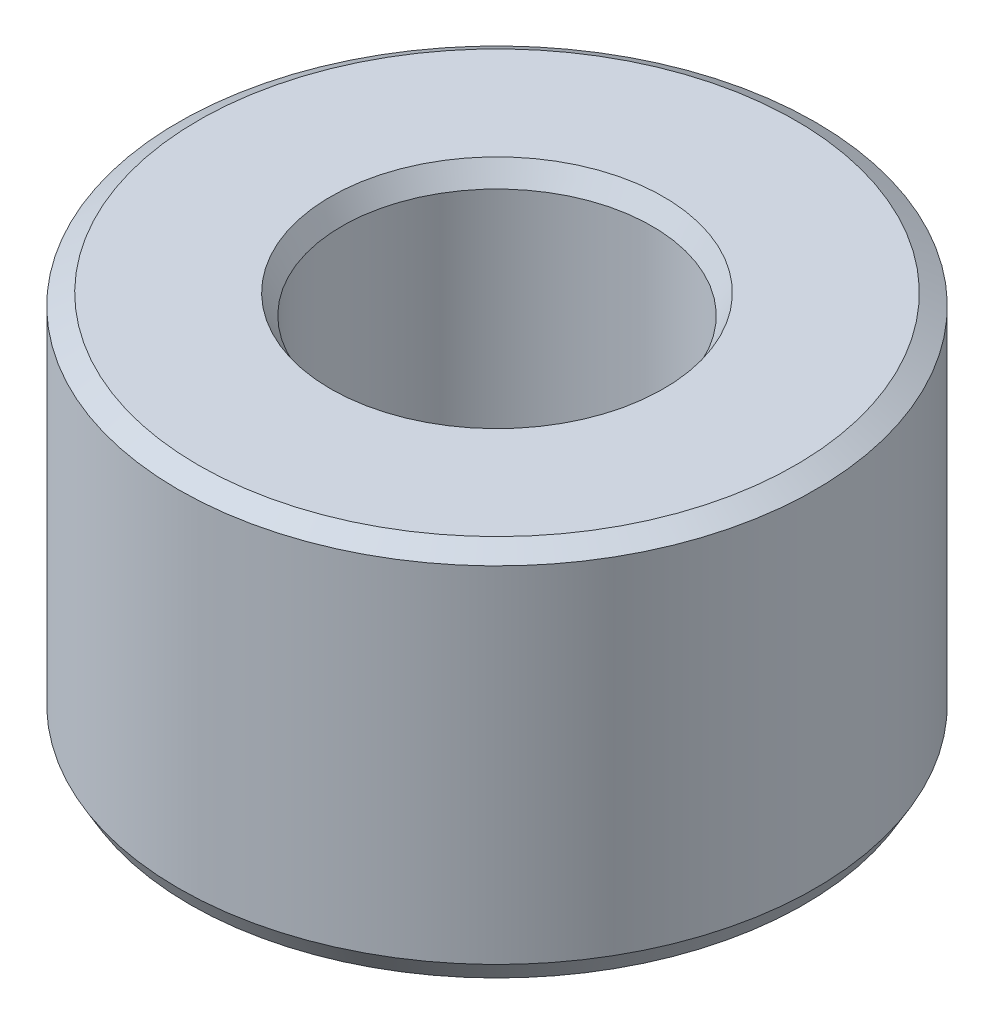
ISO-10303-21;
HEADER;
FILE_DESCRIPTION(('STEP AP214'),'2;1');
FILE_NAME('part.step','',(''),(''),'','','');
FILE_SCHEMA(('AUTOMOTIVE_DESIGN { 1 0 10303 214 1 1 1 1 }'));
ENDSEC;
DATA;
#1=APPLICATION_CONTEXT('core data for automotive mechanical design processes');
#2=APPLICATION_PROTOCOL_DEFINITION('international standard','automotive_design',2000,#1);
#3=PRODUCT_CONTEXT('',#1,'mechanical');
#4=PRODUCT('Part','Part','',(#3));
#5=PRODUCT_RELATED_PRODUCT_CATEGORY('part','',(#4));
#6=PRODUCT_DEFINITION_FORMATION('','',#4);
#7=PRODUCT_DEFINITION_CONTEXT('part definition',#1,'design');
#8=PRODUCT_DEFINITION('design','',#6,#7);
#9=PRODUCT_DEFINITION_SHAPE('','',#8);
#10=(LENGTH_UNIT() NAMED_UNIT(*) SI_UNIT(.MILLI.,.METRE.));
#11=(NAMED_UNIT(*) PLANE_ANGLE_UNIT() SI_UNIT($,.RADIAN.));
#12=(NAMED_UNIT(*) SI_UNIT($,.STERADIAN.) SOLID_ANGLE_UNIT());
#13=UNCERTAINTY_MEASURE_WITH_UNIT(LENGTH_MEASURE(1.E-05),#10,'distance_accuracy_value','');
#14=(GEOMETRIC_REPRESENTATION_CONTEXT(3) GLOBAL_UNCERTAINTY_ASSIGNED_CONTEXT((#13)) GLOBAL_UNIT_ASSIGNED_CONTEXT((#10,
#11,#12)) REPRESENTATION_CONTEXT('',''));
#15=CARTESIAN_POINT('',(0.,0.,0.));
#16=DIRECTION('',(0.,0.,1.));
#17=DIRECTION('',(1.,0.,0.));
#18=AXIS2_PLACEMENT_3D('',#15,#16,#17);
#19=CARTESIAN_POINT('',(0.,44.3257401234664,0.));
#20=DIRECTION('',(0.,-1.,0.));
#21=DIRECTION('',(0.,0.,-1.));
#22=AXIS2_PLACEMENT_3D('',#19,#20,#21);
#23=CYLINDRICAL_SURFACE('',#22,37.5);
#24=CARTESIAN_POINT('',(0.,2.32922679748201,0.));
#25=DIRECTION('',(0.,1.,0.));
#26=DIRECTION('',(0.,0.,1.));
#27=AXIS2_PLACEMENT_3D('',#24,#25,#26);
#28=CIRCLE('',#27,37.5);
#29=CARTESIAN_POINT('',(0.,2.32922679748201,37.5));
#30=VERTEX_POINT('',#29);
#31=EDGE_CURVE('E10',#30,#30,#28,.T.);
#32=ORIENTED_EDGE('',*,*,#31,.T.);
#33=EDGE_LOOP('',(#32));
#34=FACE_BOUND('',#33,.T.);
#35=CARTESIAN_POINT('',(0.,42.9809604049365,0.));
#36=DIRECTION('',(0.,1.,0.));
#37=DIRECTION('',(0.,0.,1.));
#38=AXIS2_PLACEMENT_3D('',#35,#36,#37);
#39=CIRCLE('',#38,37.5);
#40=CARTESIAN_POINT('',(0.,42.9809604049365,37.5));
#41=VERTEX_POINT('',#40);
#42=EDGE_CURVE('E50',#41,#41,#39,.F.);
#43=ORIENTED_EDGE('',*,*,#42,.T.);
#44=EDGE_LOOP('',(#43));
#45=FACE_BOUND('',#44,.T.);
#46=ADVANCED_FACE('F39',(#34,#45),#23,.T.);
#47=CARTESIAN_POINT('',(0.,44.3257401234664,0.));
#48=DIRECTION('',(0.,1.,0.));
#49=DIRECTION('',(0.,0.,1.));
#50=AXIS2_PLACEMENT_3D('',#47,#48,#49);
#51=PLANE('',#50);
#52=CARTESIAN_POINT('',(0.,44.3257401234664,0.));
#53=DIRECTION('',(0.,1.,0.));
#54=DIRECTION('',(0.,0.,1.));
#55=AXIS2_PLACEMENT_3D('',#52,#53,#54);
#56=CIRCLE('',#55,19.6042669580536);
#57=CARTESIAN_POINT('',(0.,44.3257401234664,19.6042669580536));
#58=VERTEX_POINT('',#57);
#59=EDGE_CURVE('E58',#58,#58,#56,.F.);
#60=ORIENTED_EDGE('',*,*,#59,.T.);
#61=EDGE_LOOP('',(#60));
#62=FACE_BOUND('',#61,.T.);
#63=CARTESIAN_POINT('',(0.,44.3257401234664,0.));
#64=DIRECTION('',(0.,1.,0.));
#65=DIRECTION('',(0.,0.,1.));
#66=AXIS2_PLACEMENT_3D('',#63,#64,#65);
#67=CIRCLE('',#66,35.1707732025181);
#68=CARTESIAN_POINT('',(0.,44.3257401234664,35.1707732025181));
#69=VERTEX_POINT('',#68);
#70=EDGE_CURVE('E61',#69,#69,#67,.T.);
#71=ORIENTED_EDGE('',*,*,#70,.T.);
#72=EDGE_LOOP('',(#71));
#73=FACE_BOUND('',#72,.T.);
#74=ADVANCED_FACE('F88',(#62,#73),#51,.T.);
#75=CARTESIAN_POINT('',(0.,0.,0.));
#76=DIRECTION('',(0.,1.,0.));
#77=DIRECTION('',(0.,0.,1.));
#78=AXIS2_PLACEMENT_3D('',#75,#76,#77);
#79=PLANE('',#78);
#80=CARTESIAN_POINT('',(0.,0.,0.));
#81=DIRECTION('',(0.,1.,0.));
#82=DIRECTION('',(0.,0.,1.));
#83=AXIS2_PLACEMENT_3D('',#80,#81,#82);
#84=CIRCLE('',#83,20.5887140370056);
#85=CARTESIAN_POINT('',(0.,0.,20.5887140370056));
#86=VERTEX_POINT('',#85);
#87=EDGE_CURVE('E51',#86,#86,#84,.T.);
#88=ORIENTED_EDGE('',*,*,#87,.T.);
#89=EDGE_LOOP('',(#88));
#90=FACE_BOUND('',#89,.T.);
#91=CARTESIAN_POINT('',(0.,0.,0.));
#92=DIRECTION('',(0.,1.,0.));
#93=DIRECTION('',(0.,0.,1.));
#94=AXIS2_PLACEMENT_3D('',#91,#92,#93);
#95=CIRCLE('',#94,36.1552202814701);
#96=CARTESIAN_POINT('',(0.,0.,36.1552202814701));
#97=VERTEX_POINT('',#96);
#98=EDGE_CURVE('E54',#97,#97,#95,.F.);
#99=ORIENTED_EDGE('',*,*,#98,.T.);
#100=EDGE_LOOP('',(#99));
#101=FACE_BOUND('',#100,.T.);
#102=ADVANCED_FACE('F83',(#90,#101),#79,.F.);
#103=CARTESIAN_POINT('',(0.,44.3257401234664,0.));
#104=DIRECTION('',(0.,-1.,0.));
#105=DIRECTION('',(0.,0.,-1.));
#106=AXIS2_PLACEMENT_3D('',#103,#104,#105);
#107=CYLINDRICAL_SURFACE('',#106,18.2594872395236);
#108=CARTESIAN_POINT('',(0.,41.9965133259844,0.));
#109=DIRECTION('',(0.,1.,0.));
#110=DIRECTION('',(0.,0.,1.));
#111=AXIS2_PLACEMENT_3D('',#108,#109,#110);
#112=CIRCLE('',#111,18.2594872395236);
#113=CARTESIAN_POINT('',(0.,41.9965133259844,18.2594872395236));
#114=VERTEX_POINT('',#113);
#115=EDGE_CURVE('E67',#114,#114,#112,.T.);
#116=ORIENTED_EDGE('',*,*,#115,.T.);
#117=EDGE_LOOP('',(#116));
#118=FACE_BOUND('',#117,.T.);
#119=CARTESIAN_POINT('',(0.,1.34477971852991,0.));
#120=DIRECTION('',(0.,1.,0.));
#121=DIRECTION('',(0.,0.,1.));
#122=AXIS2_PLACEMENT_3D('',#119,#120,#121);
#123=CIRCLE('',#122,18.2594872395236);
#124=CARTESIAN_POINT('',(0.,1.34477971852991,18.2594872395236));
#125=VERTEX_POINT('',#124);
#126=EDGE_CURVE('E69',#125,#125,#123,.F.);
#127=ORIENTED_EDGE('',*,*,#126,.T.);
#128=EDGE_LOOP('',(#127));
#129=FACE_BOUND('',#128,.T.);
#130=ADVANCED_FACE('F71',(#118,#129),#107,.F.);
#131=CARTESIAN_POINT('',(0.,41.9965133259844,0.));
#132=DIRECTION('',(0.,1.,0.));
#133=DIRECTION('',(0.,0.,1.));
#134=AXIS2_PLACEMENT_3D('',#131,#132,#133);
#135=CONICAL_SURFACE('',#134,18.2594872395236,0.523598775598305);
#136=ORIENTED_EDGE('',*,*,#59,.F.);
#137=EDGE_LOOP('',(#136));
#138=FACE_BOUND('',#137,.T.);
#139=ORIENTED_EDGE('',*,*,#115,.F.);
#140=EDGE_LOOP('',(#139));
#141=FACE_BOUND('',#140,.T.);
#142=ADVANCED_FACE('F77',(#138,#141),#135,.F.);
#143=CARTESIAN_POINT('',(0.,0.,0.));
#144=DIRECTION('',(0.,-1.,0.));
#145=DIRECTION('',(0.,0.,-1.));
#146=AXIS2_PLACEMENT_3D('',#143,#144,#145);
#147=CONICAL_SURFACE('',#146,20.5887140370056,1.0471975511966);
#148=ORIENTED_EDGE('',*,*,#126,.F.);
#149=EDGE_LOOP('',(#148));
#150=FACE_BOUND('',#149,.T.);
#151=ORIENTED_EDGE('',*,*,#87,.F.);
#152=EDGE_LOOP('',(#151));
#153=FACE_BOUND('',#152,.T.);
#154=ADVANCED_FACE('F73',(#150,#153),#147,.F.);
#155=CARTESIAN_POINT('',(0.,2.32922679748201,0.));
#156=DIRECTION('',(0.,1.,0.));
#157=DIRECTION('',(0.,0.,1.));
#158=AXIS2_PLACEMENT_3D('',#155,#156,#157);
#159=CONICAL_SURFACE('',#158,37.5,0.5235987755983);
#160=ORIENTED_EDGE('',*,*,#98,.F.);
#161=EDGE_LOOP('',(#160));
#162=FACE_BOUND('',#161,.T.);
#163=ORIENTED_EDGE('',*,*,#31,.F.);
#164=EDGE_LOOP('',(#163));
#165=FACE_BOUND('',#164,.T.);
#166=ADVANCED_FACE('F76',(#162,#165),#159,.T.);
#167=CARTESIAN_POINT('',(0.,44.3257401234664,0.));
#168=DIRECTION('',(0.,-1.,0.));
#169=DIRECTION('',(0.,0.,-1.));
#170=AXIS2_PLACEMENT_3D('',#167,#168,#169);
#171=CONICAL_SURFACE('',#170,35.1707732025181,1.04719755119659);
#172=ORIENTED_EDGE('',*,*,#42,.F.);
#173=EDGE_LOOP('',(#172));
#174=FACE_BOUND('',#173,.T.);
#175=ORIENTED_EDGE('',*,*,#70,.F.);
#176=EDGE_LOOP('',(#175));
#177=FACE_BOUND('',#176,.T.);
#178=ADVANCED_FACE('F45',(#174,#177),#171,.T.);
#179=CLOSED_SHELL('',(#46,#74,#102,#130,#142,#154,#166,#178));
#180=MANIFOLD_SOLID_BREP('B2',#179);
#181=ADVANCED_BREP_SHAPE_REPRESENTATION('',(#18,#180),#14);
#182=SHAPE_DEFINITION_REPRESENTATION(#9,#181);
ENDSEC;
END-ISO-10303-21;
